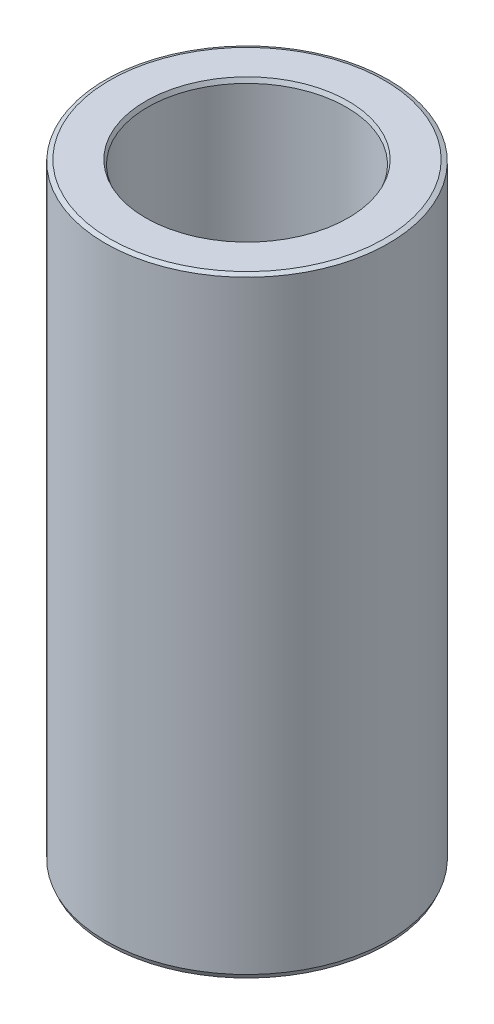
ISO-10303-21;
HEADER;
FILE_DESCRIPTION(('STEP AP214'),'2;1');
FILE_NAME('part.step','',(''),(''),'','','');
FILE_SCHEMA(('AUTOMOTIVE_DESIGN { 1 0 10303 214 1 1 1 1 }'));
ENDSEC;
DATA;
#1=APPLICATION_CONTEXT('core data for automotive mechanical design processes');
#2=APPLICATION_PROTOCOL_DEFINITION('international standard','automotive_design',2000,#1);
#3=PRODUCT_CONTEXT('',#1,'mechanical');
#4=PRODUCT('Part','Part','',(#3));
#5=PRODUCT_RELATED_PRODUCT_CATEGORY('part','',(#4));
#6=PRODUCT_DEFINITION_FORMATION('','',#4);
#7=PRODUCT_DEFINITION_CONTEXT('part definition',#1,'design');
#8=PRODUCT_DEFINITION('design','',#6,#7);
#9=PRODUCT_DEFINITION_SHAPE('','',#8);
#10=(LENGTH_UNIT() NAMED_UNIT(*) SI_UNIT(.MILLI.,.METRE.));
#11=(NAMED_UNIT(*) PLANE_ANGLE_UNIT() SI_UNIT($,.RADIAN.));
#12=(NAMED_UNIT(*) SI_UNIT($,.STERADIAN.) SOLID_ANGLE_UNIT());
#13=UNCERTAINTY_MEASURE_WITH_UNIT(LENGTH_MEASURE(1.E-05),#10,'distance_accuracy_value','');
#14=(GEOMETRIC_REPRESENTATION_CONTEXT(3) GLOBAL_UNCERTAINTY_ASSIGNED_CONTEXT((#13)) GLOBAL_UNIT_ASSIGNED_CONTEXT((#10,
#11,#12)) REPRESENTATION_CONTEXT('',''));
#15=CARTESIAN_POINT('',(0.,0.,0.));
#16=DIRECTION('',(0.,0.,1.));
#17=DIRECTION('',(1.,0.,0.));
#18=AXIS2_PLACEMENT_3D('',#15,#16,#17);
#19=CARTESIAN_POINT('',(0.,193.804306536336,0.));
#20=DIRECTION('',(0.,-1.,0.));
#21=DIRECTION('',(0.,0.,-1.));
#22=AXIS2_PLACEMENT_3D('',#19,#20,#21);
#23=CYLINDRICAL_SURFACE('',#22,45.);
#24=CARTESIAN_POINT('',(0.,1.38486147639902,0.));
#25=DIRECTION('',(0.,1.,0.));
#26=DIRECTION('',(0.,0.,1.));
#27=AXIS2_PLACEMENT_3D('',#24,#25,#26);
#28=CIRCLE('',#27,45.);
#29=CARTESIAN_POINT('',(0.,1.38486147639902,45.));
#30=VERTEX_POINT('',#29);
#31=EDGE_CURVE('E10',#30,#30,#28,.T.);
#32=ORIENTED_EDGE('',*,*,#31,.T.);
#33=EDGE_LOOP('',(#32));
#34=FACE_BOUND('',#33,.T.);
#35=CARTESIAN_POINT('',(0.,193.215867788144,0.));
#36=DIRECTION('',(0.,1.,0.));
#37=DIRECTION('',(0.,0.,1.));
#38=AXIS2_PLACEMENT_3D('',#35,#36,#37);
#39=CIRCLE('',#38,45.);
#40=CARTESIAN_POINT('',(0.,193.215867788144,45.));
#41=VERTEX_POINT('',#40);
#42=EDGE_CURVE('E50',#41,#41,#39,.F.);
#43=ORIENTED_EDGE('',*,*,#42,.T.);
#44=EDGE_LOOP('',(#43));
#45=FACE_BOUND('',#44,.T.);
#46=ADVANCED_FACE('F39',(#34,#45),#23,.T.);
#47=CARTESIAN_POINT('',(0.,193.804306536336,0.));
#48=DIRECTION('',(0.,1.,0.));
#49=DIRECTION('',(0.,0.,1.));
#50=AXIS2_PLACEMENT_3D('',#47,#48,#49);
#51=PLANE('',#50);
#52=CARTESIAN_POINT('',(0.,193.804306536336,0.));
#53=DIRECTION('',(0.,1.,0.));
#54=DIRECTION('',(0.,0.,1.));
#55=AXIS2_PLACEMENT_3D('',#52,#53,#54);
#56=CIRCLE('',#55,32.1661623439662);
#57=CARTESIAN_POINT('',(0.,193.804306536336,32.1661623439662));
#58=VERTEX_POINT('',#57);
#59=EDGE_CURVE('E58',#58,#58,#56,.F.);
#60=ORIENTED_EDGE('',*,*,#59,.T.);
#61=EDGE_LOOP('',(#60));
#62=FACE_BOUND('',#61,.T.);
#63=CARTESIAN_POINT('',(0.,193.804306536336,0.));
#64=DIRECTION('',(0.,1.,0.));
#65=DIRECTION('',(0.,0.,1.));
#66=AXIS2_PLACEMENT_3D('',#63,#64,#65);
#67=CIRCLE('',#66,43.615138523601);
#68=CARTESIAN_POINT('',(0.,193.804306536336,43.615138523601));
#69=VERTEX_POINT('',#68);
#70=EDGE_CURVE('E61',#69,#69,#67,.T.);
#71=ORIENTED_EDGE('',*,*,#70,.T.);
#72=EDGE_LOOP('',(#71));
#73=FACE_BOUND('',#72,.T.);
#74=ADVANCED_FACE('F88',(#62,#73),#51,.T.);
#75=CARTESIAN_POINT('',(0.,0.,0.));
#76=DIRECTION('',(0.,1.,0.));
#77=DIRECTION('',(0.,0.,1.));
#78=AXIS2_PLACEMENT_3D('',#75,#76,#77);
#79=PLANE('',#78);
#80=CARTESIAN_POINT('',(0.,0.,0.));
#81=DIRECTION('',(0.,1.,0.));
#82=DIRECTION('',(0.,0.,1.));
#83=AXIS2_PLACEMENT_3D('',#80,#81,#82);
#84=CIRCLE('',#83,32.9625850721732);
#85=CARTESIAN_POINT('',(0.,0.,32.9625850721732));
#86=VERTEX_POINT('',#85);
#87=EDGE_CURVE('E51',#86,#86,#84,.T.);
#88=ORIENTED_EDGE('',*,*,#87,.T.);
#89=EDGE_LOOP('',(#88));
#90=FACE_BOUND('',#89,.T.);
#91=CARTESIAN_POINT('',(0.,0.,0.));
#92=DIRECTION('',(0.,1.,0.));
#93=DIRECTION('',(0.,0.,1.));
#94=AXIS2_PLACEMENT_3D('',#91,#92,#93);
#95=CIRCLE('',#94,44.4115612518079);
#96=CARTESIAN_POINT('',(0.,0.,44.4115612518079));
#97=VERTEX_POINT('',#96);
#98=EDGE_CURVE('E54',#97,#97,#95,.F.);
#99=ORIENTED_EDGE('',*,*,#98,.T.);
#100=EDGE_LOOP('',(#99));
#101=FACE_BOUND('',#100,.T.);
#102=ADVANCED_FACE('F83',(#90,#101),#79,.F.);
#103=CARTESIAN_POINT('',(0.,193.804306536336,0.));
#104=DIRECTION('',(0.,-1.,0.));
#105=DIRECTION('',(0.,0.,-1.));
#106=AXIS2_PLACEMENT_3D('',#103,#104,#105);
#107=CYLINDRICAL_SURFACE('',#106,31.5777235957741);
#108=CARTESIAN_POINT('',(0.,192.419445059937,0.));
#109=DIRECTION('',(0.,1.,0.));
#110=DIRECTION('',(0.,0.,1.));
#111=AXIS2_PLACEMENT_3D('',#108,#109,#110);
#112=CIRCLE('',#111,31.5777235957741);
#113=CARTESIAN_POINT('',(0.,192.419445059937,31.5777235957741));
#114=VERTEX_POINT('',#113);
#115=EDGE_CURVE('E67',#114,#114,#112,.T.);
#116=ORIENTED_EDGE('',*,*,#115,.T.);
#117=EDGE_LOOP('',(#116));
#118=FACE_BOUND('',#117,.T.);
#119=CARTESIAN_POINT('',(0.,0.588438748192088,0.));
#120=DIRECTION('',(0.,1.,0.));
#121=DIRECTION('',(0.,0.,1.));
#122=AXIS2_PLACEMENT_3D('',#119,#120,#121);
#123=CIRCLE('',#122,31.5777235957741);
#124=CARTESIAN_POINT('',(0.,0.588438748192088,31.5777235957741));
#125=VERTEX_POINT('',#124);
#126=EDGE_CURVE('E69',#125,#125,#123,.F.);
#127=ORIENTED_EDGE('',*,*,#126,.T.);
#128=EDGE_LOOP('',(#127));
#129=FACE_BOUND('',#128,.T.);
#130=ADVANCED_FACE('F71',(#118,#129),#107,.F.);
#131=CARTESIAN_POINT('',(0.,192.419445059937,0.));
#132=DIRECTION('',(0.,1.,0.));
#133=DIRECTION('',(0.,0.,1.));
#134=AXIS2_PLACEMENT_3D('',#131,#132,#133);
#135=CONICAL_SURFACE('',#134,31.5777235957741,0.401792737145093);
#136=ORIENTED_EDGE('',*,*,#59,.F.);
#137=EDGE_LOOP('',(#136));
#138=FACE_BOUND('',#137,.T.);
#139=ORIENTED_EDGE('',*,*,#115,.F.);
#140=EDGE_LOOP('',(#139));
#141=FACE_BOUND('',#140,.T.);
#142=ADVANCED_FACE('F77',(#138,#141),#135,.F.);
#143=CARTESIAN_POINT('',(0.,0.,0.));
#144=DIRECTION('',(0.,-1.,0.));
#145=DIRECTION('',(0.,0.,-1.));
#146=AXIS2_PLACEMENT_3D('',#143,#144,#145);
#147=CONICAL_SURFACE('',#146,32.9625850721732,1.1690035896498);
#148=ORIENTED_EDGE('',*,*,#126,.F.);
#149=EDGE_LOOP('',(#148));
#150=FACE_BOUND('',#149,.T.);
#151=ORIENTED_EDGE('',*,*,#87,.F.);
#152=EDGE_LOOP('',(#151));
#153=FACE_BOUND('',#152,.T.);
#154=ADVANCED_FACE('F73',(#150,#153),#147,.F.);
#155=CARTESIAN_POINT('',(0.,1.38486147639902,0.));
#156=DIRECTION('',(0.,1.,0.));
#157=DIRECTION('',(0.,0.,1.));
#158=AXIS2_PLACEMENT_3D('',#155,#156,#157);
#159=CONICAL_SURFACE('',#158,45.,0.401792737145097);
#160=ORIENTED_EDGE('',*,*,#98,.F.);
#161=EDGE_LOOP('',(#160));
#162=FACE_BOUND('',#161,.T.);
#163=ORIENTED_EDGE('',*,*,#31,.F.);
#164=EDGE_LOOP('',(#163));
#165=FACE_BOUND('',#164,.T.);
#166=ADVANCED_FACE('F76',(#162,#165),#159,.T.);
#167=CARTESIAN_POINT('',(0.,193.804306536336,0.));
#168=DIRECTION('',(0.,-1.,0.));
#169=DIRECTION('',(0.,0.,-1.));
#170=AXIS2_PLACEMENT_3D('',#167,#168,#169);
#171=CONICAL_SURFACE('',#170,43.615138523601,1.16900358964982);
#172=ORIENTED_EDGE('',*,*,#42,.F.);
#173=EDGE_LOOP('',(#172));
#174=FACE_BOUND('',#173,.T.);
#175=ORIENTED_EDGE('',*,*,#70,.F.);
#176=EDGE_LOOP('',(#175));
#177=FACE_BOUND('',#176,.T.);
#178=ADVANCED_FACE('F45',(#174,#177),#171,.T.);
#179=CLOSED_SHELL('',(#46,#74,#102,#130,#142,#154,#166,#178));
#180=MANIFOLD_SOLID_BREP('B2',#179);
#181=ADVANCED_BREP_SHAPE_REPRESENTATION('',(#18,#180),#14);
#182=SHAPE_DEFINITION_REPRESENTATION(#9,#181);
ENDSEC;
END-ISO-10303-21;
